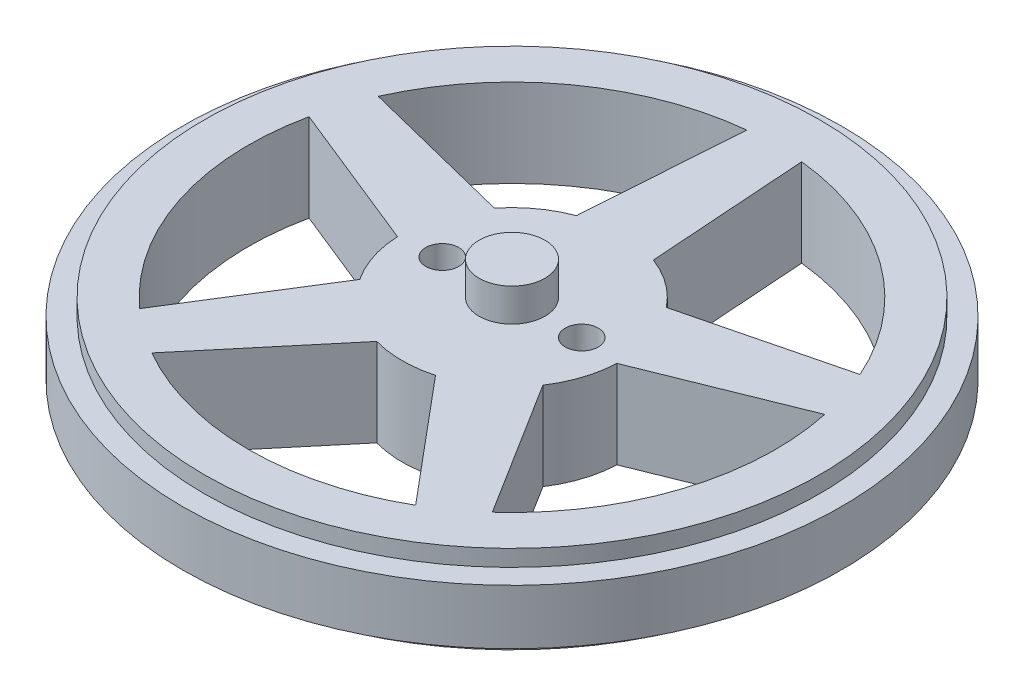
ISO-10303-21;
HEADER;
FILE_DESCRIPTION(('STEP AP214'),'2;1');
FILE_NAME('part.step','',(''),(''),'','','');
FILE_SCHEMA(('AUTOMOTIVE_DESIGN { 1 0 10303 214 1 1 1 1 }'));
ENDSEC;
DATA;
#1=APPLICATION_CONTEXT('core data for automotive mechanical design processes');
#2=APPLICATION_PROTOCOL_DEFINITION('international standard','automotive_design',2000,#1);
#3=PRODUCT_CONTEXT('',#1,'mechanical');
#4=PRODUCT('Part','Part','',(#3));
#5=PRODUCT_RELATED_PRODUCT_CATEGORY('part','',(#4));
#6=PRODUCT_DEFINITION_FORMATION('','',#4);
#7=PRODUCT_DEFINITION_CONTEXT('part definition',#1,'design');
#8=PRODUCT_DEFINITION('design','',#6,#7);
#9=PRODUCT_DEFINITION_SHAPE('','',#8);
#10=(LENGTH_UNIT() NAMED_UNIT(*) SI_UNIT(.MILLI.,.METRE.));
#11=(NAMED_UNIT(*) PLANE_ANGLE_UNIT() SI_UNIT($,.RADIAN.));
#12=(NAMED_UNIT(*) SI_UNIT($,.STERADIAN.) SOLID_ANGLE_UNIT());
#13=UNCERTAINTY_MEASURE_WITH_UNIT(LENGTH_MEASURE(1.E-05),#10,'distance_accuracy_value','');
#14=(GEOMETRIC_REPRESENTATION_CONTEXT(3) GLOBAL_UNCERTAINTY_ASSIGNED_CONTEXT((#13)) GLOBAL_UNIT_ASSIGNED_CONTEXT((#10,
#11,#12)) REPRESENTATION_CONTEXT('',''));
#15=CARTESIAN_POINT('',(0.,0.,0.));
#16=DIRECTION('',(0.,0.,1.));
#17=DIRECTION('',(1.,0.,0.));
#18=AXIS2_PLACEMENT_3D('',#15,#16,#17);
#19=CARTESIAN_POINT('',(0.,8.,0.));
#20=DIRECTION('',(0.,-1.,0.));
#21=DIRECTION('',(0.,0.,-1.));
#22=AXIS2_PLACEMENT_3D('',#19,#20,#21);
#23=CYLINDRICAL_SURFACE('',#22,28.);
#24=CARTESIAN_POINT('',(0.,6.5,0.));
#25=DIRECTION('',(0.,-1.,0.));
#26=DIRECTION('',(0.,0.,-1.));
#27=AXIS2_PLACEMENT_3D('',#24,#25,#26);
#28=CIRCLE('',#27,28.);
#29=CARTESIAN_POINT('',(0.,6.5,-28.));
#30=VERTEX_POINT('',#29);
#31=EDGE_CURVE('E205',#30,#30,#28,.T.);
#32=ORIENTED_EDGE('',*,*,#31,.F.);
#33=EDGE_LOOP('',(#32));
#34=FACE_BOUND('',#33,.T.);
#35=CARTESIAN_POINT('',(0.,8.,0.));
#36=DIRECTION('',(0.,1.,0.));
#37=DIRECTION('',(0.,0.,1.));
#38=AXIS2_PLACEMENT_3D('',#35,#36,#37);
#39=CIRCLE('',#38,28.);
#40=CARTESIAN_POINT('',(0.,8.,28.));
#41=VERTEX_POINT('',#40);
#42=EDGE_CURVE('E11',#41,#41,#39,.T.);
#43=ORIENTED_EDGE('',*,*,#42,.F.);
#44=EDGE_LOOP('',(#43));
#45=FACE_BOUND('',#44,.T.);
#46=ADVANCED_FACE('F35',(#34,#45),#23,.T.);
#47=CARTESIAN_POINT('',(0.,8.,0.));
#48=DIRECTION('',(0.,1.,0.));
#49=DIRECTION('',(0.,0.,1.));
#50=AXIS2_PLACEMENT_3D('',#47,#48,#49);
#51=PLANE('',#50);
#52=CARTESIAN_POINT('',(0.,8.,0.));
#53=DIRECTION('',(0.,1.,0.));
#54=DIRECTION('',(0.,0.,1.));
#55=AXIS2_PLACEMENT_3D('',#52,#53,#54);
#56=CIRCLE('',#55,3.);
#57=CARTESIAN_POINT('',(0.,8.,3.));
#58=VERTEX_POINT('',#57);
#59=EDGE_CURVE('E198',#58,#58,#56,.T.);
#60=ORIENTED_EDGE('',*,*,#59,.F.);
#61=EDGE_LOOP('',(#60));
#62=FACE_BOUND('',#61,.T.);
#63=CARTESIAN_POINT('',(6.35,8.,0.));
#64=DIRECTION('',(0.,1.,0.));
#65=DIRECTION('',(0.,0.,1.));
#66=AXIS2_PLACEMENT_3D('',#63,#64,#65);
#67=CIRCLE('',#66,1.5);
#68=CARTESIAN_POINT('',(6.35,8.,1.5));
#69=VERTEX_POINT('',#68);
#70=EDGE_CURVE('E207',#69,#69,#67,.T.);
#71=ORIENTED_EDGE('',*,*,#70,.F.);
#72=EDGE_LOOP('',(#71));
#73=FACE_BOUND('',#72,.T.);
#74=CARTESIAN_POINT('',(-6.35,8.,0.));
#75=DIRECTION('',(0.,1.,0.));
#76=DIRECTION('',(0.,0.,1.));
#77=AXIS2_PLACEMENT_3D('',#74,#75,#76);
#78=CIRCLE('',#77,1.5);
#79=CARTESIAN_POINT('',(-6.35,8.,1.5));
#80=VERTEX_POINT('',#79);
#81=EDGE_CURVE('E213',#80,#80,#78,.T.);
#82=ORIENTED_EDGE('',*,*,#81,.F.);
#83=EDGE_LOOP('',(#82));
#84=FACE_BOUND('',#83,.T.);
#85=ORIENTED_EDGE('',*,*,#42,.T.);
#86=EDGE_LOOP('',(#85));
#87=FACE_BOUND('',#86,.T.);
#88=DIRECTION('',(0.970061610860864,0.,0.242858953168348));
#89=VECTOR('',#88,1.);
#90=CARTESIAN_POINT('',(-7.82745958062809,8.,-6.22341357404708));
#91=LINE('',#90,#89);
#92=CARTESIAN_POINT('',(-21.9286406610389,8.,-9.75370282298126));
#93=VERTEX_POINT('',#92);
#94=CARTESIAN_POINT('',(-7.82745958062809,8.,-6.22341357404708));
#95=VERTEX_POINT('',#94);
#96=EDGE_CURVE('E346',#93,#95,#91,.T.);
#97=ORIENTED_EDGE('',*,*,#96,.F.);
#98=CARTESIAN_POINT('',(0.,8.,0.));
#99=DIRECTION('',(0.,1.,0.));
#100=DIRECTION('',(0.,0.,1.));
#101=AXIS2_PLACEMENT_3D('',#98,#99,#100);
#102=CIRCLE('',#101,24.);
#103=CARTESIAN_POINT('',(-2.5,8.,-23.86943652456));
#104=VERTEX_POINT('',#103);
#105=EDGE_CURVE('E344',#104,#93,#102,.T.);
#106=ORIENTED_EDGE('',*,*,#105,.F.);
#107=DIRECTION('',(0.0687929333953781,0.,-0.997630959982126));
#108=VECTOR('',#107,1.);
#109=CARTESIAN_POINT('',(-2.5,8.,-23.86943652456));
#110=LINE('',#109,#108);
#111=CARTESIAN_POINT('',(-3.5,8.,-9.3674969975976));
#112=VERTEX_POINT('',#111);
#113=EDGE_CURVE('E352',#112,#104,#110,.T.);
#114=ORIENTED_EDGE('',*,*,#113,.F.);
#115=CARTESIAN_POINT('',(0.,8.,0.));
#116=DIRECTION('',(0.,-1.,0.));
#117=DIRECTION('',(0.,0.,1.));
#118=AXIS2_PLACEMENT_3D('',#115,#116,#117);
#119=CIRCLE('',#118,10.);
#120=EDGE_CURVE('E349',#95,#112,#119,.T.);
#121=ORIENTED_EDGE('',*,*,#120,.F.);
#122=EDGE_LOOP('',(#97,#106,#114,#121));
#123=FACE_BOUND('',#122,.T.);
#124=DIRECTION('',(0.970061610860867,0.,-0.242858953168335));
#125=VECTOR('',#124,1.);
#126=CARTESIAN_POINT('',(7.82745958062818,8.,-6.22341357404697));
#127=LINE('',#126,#125);
#128=CARTESIAN_POINT('',(7.82745958062818,8.,-6.22341357404697));
#129=VERTEX_POINT('',#128);
#130=CARTESIAN_POINT('',(21.928640661039,8.,-9.75370282298095));
#131=VERTEX_POINT('',#130);
#132=EDGE_CURVE('E315',#129,#131,#127,.T.);
#133=ORIENTED_EDGE('',*,*,#132,.F.);
#134=CARTESIAN_POINT('',(0.,8.,0.));
#135=DIRECTION('',(0.,-1.,0.));
#136=DIRECTION('',(0.,0.,1.));
#137=AXIS2_PLACEMENT_3D('',#134,#135,#136);
#138=CIRCLE('',#137,10.);
#139=CARTESIAN_POINT('',(3.5,8.,-9.3674969975976));
#140=VERTEX_POINT('',#139);
#141=EDGE_CURVE('E313',#140,#129,#138,.T.);
#142=ORIENTED_EDGE('',*,*,#141,.F.);
#143=DIRECTION('',(0.0687929333953781,0.,0.997630959982126));
#144=VECTOR('',#143,1.);
#145=CARTESIAN_POINT('',(3.5,8.,-9.3674969975976));
#146=LINE('',#145,#144);
#147=CARTESIAN_POINT('',(2.5,8.,-23.86943652456));
#148=VERTEX_POINT('',#147);
#149=EDGE_CURVE('E321',#148,#140,#146,.T.);
#150=ORIENTED_EDGE('',*,*,#149,.F.);
#151=CARTESIAN_POINT('',(0.,8.,0.));
#152=DIRECTION('',(0.,1.,0.));
#153=DIRECTION('',(0.,0.,1.));
#154=AXIS2_PLACEMENT_3D('',#151,#152,#153);
#155=CIRCLE('',#154,24.);
#156=EDGE_CURVE('E318',#131,#148,#155,.T.);
#157=ORIENTED_EDGE('',*,*,#156,.F.);
#158=EDGE_LOOP('',(#133,#142,#150,#157));
#159=FACE_BOUND('',#158,.T.);
#160=DIRECTION('',(0.530738113298107,0.,0.847535872451878));
#161=VECTOR('',#160,1.);
#162=CARTESIAN_POINT('',(8.33763606639418,8.,5.52121588278914));
#163=LINE('',#162,#161);
#164=CARTESIAN_POINT('',(8.33763606639418,8.,5.52121588278914));
#165=VERTEX_POINT('',#164);
#166=CARTESIAN_POINT('',(16.052645255605,8.,17.841316663792));
#167=VERTEX_POINT('',#166);
#168=EDGE_CURVE('E284',#165,#167,#163,.T.);
#169=ORIENTED_EDGE('',*,*,#168,.F.);
#170=CARTESIAN_POINT('',(0.,8.,0.));
#171=DIRECTION('',(0.,-1.,0.));
#172=DIRECTION('',(0.,0.,1.));
#173=AXIS2_PLACEMENT_3D('',#170,#171,#172);
#174=CIRCLE('',#173,10.);
#175=CARTESIAN_POINT('',(9.9905785412528,8.,0.433982040019112));
#176=VERTEX_POINT('',#175);
#177=EDGE_CURVE('E282',#176,#165,#174,.T.);
#178=ORIENTED_EDGE('',*,*,#177,.F.);
#179=DIRECTION('',(-0.927545239836716,0.,0.3737108883298));
#180=VECTOR('',#179,1.);
#181=CARTESIAN_POINT('',(9.9905785412528,8.,0.433982040019112));
#182=LINE('',#181,#180);
#183=CARTESIAN_POINT('',(23.4737256329137,8.,-4.99842024150518));
#184=VERTEX_POINT('',#183);
#185=EDGE_CURVE('E290',#184,#176,#182,.T.);
#186=ORIENTED_EDGE('',*,*,#185,.F.);
#187=CARTESIAN_POINT('',(0.,8.,0.));
#188=DIRECTION('',(0.,1.,0.));
#189=DIRECTION('',(0.,0.,1.));
#190=AXIS2_PLACEMENT_3D('',#187,#188,#189);
#191=CIRCLE('',#190,24.);
#192=EDGE_CURVE('E287',#167,#184,#191,.T.);
#193=ORIENTED_EDGE('',*,*,#192,.F.);
#194=EDGE_LOOP('',(#169,#178,#186,#193));
#195=FACE_BOUND('',#194,.T.);
#196=DIRECTION('',(-0.642047417717648,0.,0.766664929028386));
#197=VECTOR('',#196,1.);
#198=CARTESIAN_POINT('',(-2.67451710576965,8.,9.63571264883639));
#199=LINE('',#198,#197);
#200=CARTESIAN_POINT('',(-2.67451710576965,8.,9.63571264883639));
#201=VERTEX_POINT('',#200);
#202=CARTESIAN_POINT('',(-12.0075602837305,8.,20.7802429252542));
#203=VERTEX_POINT('',#202);
#204=EDGE_CURVE('E253',#201,#203,#199,.T.);
#205=ORIENTED_EDGE('',*,*,#204,.F.);
#206=CARTESIAN_POINT('',(0.,8.,0.));
#207=DIRECTION('',(0.,-1.,0.));
#208=DIRECTION('',(0.,0.,1.));
#209=AXIS2_PLACEMENT_3D('',#206,#207,#208);
#210=CIRCLE('',#209,10.);
#211=CARTESIAN_POINT('',(2.67451710576952,8.,9.63571264883643));
#212=VERTEX_POINT('',#211);
#213=EDGE_CURVE('E251',#212,#201,#210,.T.);
#214=ORIENTED_EDGE('',*,*,#213,.F.);
#215=DIRECTION('',(-0.642047417717637,0.,-0.766664929028395));
#216=VECTOR('',#215,1.);
#217=CARTESIAN_POINT('',(2.67451710576952,8.,9.63571264883643));
#218=LINE('',#217,#216);
#219=CARTESIAN_POINT('',(12.0075602837302,8.,20.7802429252544));
#220=VERTEX_POINT('',#219);
#221=EDGE_CURVE('E259',#220,#212,#218,.T.);
#222=ORIENTED_EDGE('',*,*,#221,.F.);
#223=CARTESIAN_POINT('',(0.,8.,0.));
#224=DIRECTION('',(0.,1.,0.));
#225=DIRECTION('',(0.,0.,1.));
#226=AXIS2_PLACEMENT_3D('',#223,#224,#225);
#227=CIRCLE('',#226,24.);
#228=EDGE_CURVE('E256',#203,#220,#227,.T.);
#229=ORIENTED_EDGE('',*,*,#228,.F.);
#230=EDGE_LOOP('',(#205,#214,#222,#229));
#231=FACE_BOUND('',#230,.T.);
#232=DIRECTION('',(-0.927545239836711,0.,-0.373710888329813));
#233=VECTOR('',#232,1.);
#234=CARTESIAN_POINT('',(-9.9905785412528,8.,0.433982040018968));
#235=LINE('',#234,#233);
#236=CARTESIAN_POINT('',(-9.9905785412528,8.,0.433982040018968));
#237=VERTEX_POINT('',#236);
#238=CARTESIAN_POINT('',(-23.4737256329137,8.,-4.99842024150553));
#239=VERTEX_POINT('',#238);
#240=EDGE_CURVE('E222',#237,#239,#235,.T.);
#241=ORIENTED_EDGE('',*,*,#240,.F.);
#242=CARTESIAN_POINT('',(0.,8.,0.));
#243=DIRECTION('',(0.,-1.,0.));
#244=DIRECTION('',(0.,0.,1.));
#245=AXIS2_PLACEMENT_3D('',#242,#243,#244);
#246=CIRCLE('',#245,10.);
#247=CARTESIAN_POINT('',(-8.33763606639425,8.,5.52121588278903));
#248=VERTEX_POINT('',#247);
#249=EDGE_CURVE('E220',#248,#237,#246,.T.);
#250=ORIENTED_EDGE('',*,*,#249,.F.);
#251=DIRECTION('',(0.530738113298119,0.,-0.84753587245187));
#252=VECTOR('',#251,1.);
#253=CARTESIAN_POINT('',(-8.33763606639425,8.,5.52121588278903));
#254=LINE('',#253,#252);
#255=CARTESIAN_POINT('',(-16.0526452556052,8.,17.8413166637918));
#256=VERTEX_POINT('',#255);
#257=EDGE_CURVE('E228',#256,#248,#254,.T.);
#258=ORIENTED_EDGE('',*,*,#257,.F.);
#259=CARTESIAN_POINT('',(0.,8.,0.));
#260=DIRECTION('',(0.,1.,0.));
#261=DIRECTION('',(0.,0.,1.));
#262=AXIS2_PLACEMENT_3D('',#259,#260,#261);
#263=CIRCLE('',#262,24.);
#264=EDGE_CURVE('E225',#239,#256,#263,.T.);
#265=ORIENTED_EDGE('',*,*,#264,.F.);
#266=EDGE_LOOP('',(#241,#250,#258,#265));
#267=FACE_BOUND('',#266,.T.);
#268=ADVANCED_FACE('F382',(#62,#73,#84,#87,#123,#159,#195,#231,#267),#51,.T.);
#269=CARTESIAN_POINT('',(0.,0.,0.));
#270=DIRECTION('',(0.,1.,0.));
#271=DIRECTION('',(0.,0.,1.));
#272=AXIS2_PLACEMENT_3D('',#269,#270,#271);
#273=PLANE('',#272);
#274=CARTESIAN_POINT('',(6.35,0.,0.));
#275=DIRECTION('',(0.,1.,0.));
#276=DIRECTION('',(0.,0.,1.));
#277=AXIS2_PLACEMENT_3D('',#274,#275,#276);
#278=CIRCLE('',#277,1.5);
#279=CARTESIAN_POINT('',(6.35,0.,1.5));
#280=VERTEX_POINT('',#279);
#281=EDGE_CURVE('E210',#280,#280,#278,.F.);
#282=ORIENTED_EDGE('',*,*,#281,.F.);
#283=EDGE_LOOP('',(#282));
#284=FACE_BOUND('',#283,.T.);
#285=CARTESIAN_POINT('',(-6.35,0.,0.));
#286=DIRECTION('',(0.,1.,0.));
#287=DIRECTION('',(0.,0.,1.));
#288=AXIS2_PLACEMENT_3D('',#285,#286,#287);
#289=CIRCLE('',#288,1.5);
#290=CARTESIAN_POINT('',(-6.35,0.,1.5));
#291=VERTEX_POINT('',#290);
#292=EDGE_CURVE('E216',#291,#291,#289,.F.);
#293=ORIENTED_EDGE('',*,*,#292,.F.);
#294=EDGE_LOOP('',(#293));
#295=FACE_BOUND('',#294,.T.);
#296=CARTESIAN_POINT('',(0.,0.,0.));
#297=DIRECTION('',(0.,-1.,0.));
#298=DIRECTION('',(0.,0.,1.));
#299=AXIS2_PLACEMENT_3D('',#296,#297,#298);
#300=CIRCLE('',#299,10.);
#301=CARTESIAN_POINT('',(2.67451710576951,0.,9.63571264883643));
#302=VERTEX_POINT('',#301);
#303=CARTESIAN_POINT('',(-2.67451710576965,0.,9.63571264883639));
#304=VERTEX_POINT('',#303);
#305=EDGE_CURVE('E250',#302,#304,#300,.T.);
#306=ORIENTED_EDGE('',*,*,#305,.T.);
#307=DIRECTION('',(-0.642047417717648,0.,0.766664929028386));
#308=VECTOR('',#307,1.);
#309=CARTESIAN_POINT('',(-2.67451710576965,0.,9.63571264883639));
#310=LINE('',#309,#308);
#311=CARTESIAN_POINT('',(-12.0075602837305,0.,20.7802429252542));
#312=VERTEX_POINT('',#311);
#313=EDGE_CURVE('E264',#304,#312,#310,.T.);
#314=ORIENTED_EDGE('',*,*,#313,.T.);
#315=CARTESIAN_POINT('',(0.,0.,0.));
#316=DIRECTION('',(0.,1.,0.));
#317=DIRECTION('',(0.,0.,1.));
#318=AXIS2_PLACEMENT_3D('',#315,#316,#317);
#319=CIRCLE('',#318,24.);
#320=CARTESIAN_POINT('',(12.0075602837302,0.,20.7802429252544));
#321=VERTEX_POINT('',#320);
#322=EDGE_CURVE('E267',#312,#321,#319,.T.);
#323=ORIENTED_EDGE('',*,*,#322,.T.);
#324=DIRECTION('',(-0.642047417717637,0.,-0.766664929028395));
#325=VECTOR('',#324,1.);
#326=CARTESIAN_POINT('',(2.67451710576952,0.,9.63571264883643));
#327=LINE('',#326,#325);
#328=EDGE_CURVE('E254',#321,#302,#327,.T.);
#329=ORIENTED_EDGE('',*,*,#328,.T.);
#330=EDGE_LOOP('',(#306,#314,#323,#329));
#331=FACE_BOUND('',#330,.T.);
#332=CARTESIAN_POINT('',(0.,0.,0.));
#333=DIRECTION('',(0.,-1.,0.));
#334=DIRECTION('',(0.,0.,1.));
#335=AXIS2_PLACEMENT_3D('',#332,#333,#334);
#336=CIRCLE('',#335,10.);
#337=CARTESIAN_POINT('',(3.5,0.,-9.3674969975976));
#338=VERTEX_POINT('',#337);
#339=CARTESIAN_POINT('',(7.82745958062818,0.,-6.22341357404697));
#340=VERTEX_POINT('',#339);
#341=EDGE_CURVE('E312',#338,#340,#336,.T.);
#342=ORIENTED_EDGE('',*,*,#341,.T.);
#343=DIRECTION('',(0.970061610860867,0.,-0.242858953168335));
#344=VECTOR('',#343,1.);
#345=CARTESIAN_POINT('',(7.82745958062818,0.,-6.22341357404697));
#346=LINE('',#345,#344);
#347=CARTESIAN_POINT('',(21.928640661039,0.,-9.75370282298095));
#348=VERTEX_POINT('',#347);
#349=EDGE_CURVE('E326',#340,#348,#346,.T.);
#350=ORIENTED_EDGE('',*,*,#349,.T.);
#351=CARTESIAN_POINT('',(0.,0.,0.));
#352=DIRECTION('',(0.,1.,0.));
#353=DIRECTION('',(0.,0.,1.));
#354=AXIS2_PLACEMENT_3D('',#351,#352,#353);
#355=CIRCLE('',#354,24.);
#356=CARTESIAN_POINT('',(2.5,0.,-23.86943652456));
#357=VERTEX_POINT('',#356);
#358=EDGE_CURVE('E329',#348,#357,#355,.T.);
#359=ORIENTED_EDGE('',*,*,#358,.T.);
#360=DIRECTION('',(0.0687929333953781,0.,0.997630959982126));
#361=VECTOR('',#360,1.);
#362=CARTESIAN_POINT('',(3.5,0.,-9.3674969975976));
#363=LINE('',#362,#361);
#364=EDGE_CURVE('E316',#357,#338,#363,.T.);
#365=ORIENTED_EDGE('',*,*,#364,.T.);
#366=EDGE_LOOP('',(#342,#350,#359,#365));
#367=FACE_BOUND('',#366,.T.);
#368=CARTESIAN_POINT('',(0.,0.,0.));
#369=DIRECTION('',(0.,1.,0.));
#370=DIRECTION('',(0.,0.,1.));
#371=AXIS2_PLACEMENT_3D('',#368,#369,#370);
#372=CIRCLE('',#371,28.);
#373=CARTESIAN_POINT('',(0.,0.,28.));
#374=VERTEX_POINT('',#373);
#375=EDGE_CURVE('E39',#374,#374,#372,.T.);
#376=ORIENTED_EDGE('',*,*,#375,.F.);
#377=EDGE_LOOP('',(#376));
#378=FACE_BOUND('',#377,.T.);
#379=CARTESIAN_POINT('',(0.,0.,0.));
#380=DIRECTION('',(0.,1.,0.));
#381=DIRECTION('',(0.,0.,1.));
#382=AXIS2_PLACEMENT_3D('',#379,#380,#381);
#383=CIRCLE('',#382,24.);
#384=CARTESIAN_POINT('',(-2.5,0.,-23.86943652456));
#385=VERTEX_POINT('',#384);
#386=CARTESIAN_POINT('',(-21.9286406610389,0.,-9.75370282298126));
#387=VERTEX_POINT('',#386);
#388=EDGE_CURVE('E343',#385,#387,#383,.T.);
#389=ORIENTED_EDGE('',*,*,#388,.T.);
#390=DIRECTION('',(0.970061610860864,0.,0.242858953168348));
#391=VECTOR('',#390,1.);
#392=CARTESIAN_POINT('',(-7.82745958062809,0.,-6.22341357404708));
#393=LINE('',#392,#391);
#394=CARTESIAN_POINT('',(-7.82745958062809,0.,-6.22341357404708));
#395=VERTEX_POINT('',#394);
#396=EDGE_CURVE('E357',#387,#395,#393,.T.);
#397=ORIENTED_EDGE('',*,*,#396,.T.);
#398=CARTESIAN_POINT('',(0.,0.,0.));
#399=DIRECTION('',(0.,-1.,0.));
#400=DIRECTION('',(0.,0.,1.));
#401=AXIS2_PLACEMENT_3D('',#398,#399,#400);
#402=CIRCLE('',#401,10.);
#403=CARTESIAN_POINT('',(-3.5,0.,-9.3674969975976));
#404=VERTEX_POINT('',#403);
#405=EDGE_CURVE('E360',#395,#404,#402,.T.);
#406=ORIENTED_EDGE('',*,*,#405,.T.);
#407=DIRECTION('',(0.0687929333953781,0.,-0.997630959982126));
#408=VECTOR('',#407,1.);
#409=CARTESIAN_POINT('',(-2.5,0.,-23.86943652456));
#410=LINE('',#409,#408);
#411=EDGE_CURVE('E347',#404,#385,#410,.T.);
#412=ORIENTED_EDGE('',*,*,#411,.T.);
#413=EDGE_LOOP('',(#389,#397,#406,#412));
#414=FACE_BOUND('',#413,.T.);
#415=CARTESIAN_POINT('',(0.,0.,0.));
#416=DIRECTION('',(0.,-1.,0.));
#417=DIRECTION('',(0.,0.,1.));
#418=AXIS2_PLACEMENT_3D('',#415,#416,#417);
#419=CIRCLE('',#418,10.);
#420=CARTESIAN_POINT('',(9.9905785412528,0.,0.433982040019112));
#421=VERTEX_POINT('',#420);
#422=CARTESIAN_POINT('',(8.33763606639418,0.,5.52121588278914));
#423=VERTEX_POINT('',#422);
#424=EDGE_CURVE('E281',#421,#423,#419,.T.);
#425=ORIENTED_EDGE('',*,*,#424,.T.);
#426=DIRECTION('',(0.530738113298107,0.,0.847535872451878));
#427=VECTOR('',#426,1.);
#428=CARTESIAN_POINT('',(8.33763606639418,0.,5.52121588278914));
#429=LINE('',#428,#427);
#430=CARTESIAN_POINT('',(16.052645255605,0.,17.841316663792));
#431=VERTEX_POINT('',#430);
#432=EDGE_CURVE('E295',#423,#431,#429,.T.);
#433=ORIENTED_EDGE('',*,*,#432,.T.);
#434=CARTESIAN_POINT('',(0.,0.,0.));
#435=DIRECTION('',(0.,1.,0.));
#436=DIRECTION('',(0.,0.,1.));
#437=AXIS2_PLACEMENT_3D('',#434,#435,#436);
#438=CIRCLE('',#437,24.);
#439=CARTESIAN_POINT('',(23.4737256329137,0.,-4.99842024150518));
#440=VERTEX_POINT('',#439);
#441=EDGE_CURVE('E298',#431,#440,#438,.T.);
#442=ORIENTED_EDGE('',*,*,#441,.T.);
#443=DIRECTION('',(-0.927545239836716,0.,0.3737108883298));
#444=VECTOR('',#443,1.);
#445=CARTESIAN_POINT('',(9.9905785412528,0.,0.433982040019112));
#446=LINE('',#445,#444);
#447=EDGE_CURVE('E285',#440,#421,#446,.T.);
#448=ORIENTED_EDGE('',*,*,#447,.T.);
#449=EDGE_LOOP('',(#425,#433,#442,#448));
#450=FACE_BOUND('',#449,.T.);
#451=CARTESIAN_POINT('',(0.,0.,0.));
#452=DIRECTION('',(0.,-1.,0.));
#453=DIRECTION('',(0.,0.,1.));
#454=AXIS2_PLACEMENT_3D('',#451,#452,#453);
#455=CIRCLE('',#454,10.);
#456=CARTESIAN_POINT('',(-8.33763606639425,0.,5.52121588278903));
#457=VERTEX_POINT('',#456);
#458=CARTESIAN_POINT('',(-9.9905785412528,0.,0.433982040018968));
#459=VERTEX_POINT('',#458);
#460=EDGE_CURVE('E219',#457,#459,#455,.T.);
#461=ORIENTED_EDGE('',*,*,#460,.T.);
#462=DIRECTION('',(-0.927545239836711,0.,-0.373710888329813));
#463=VECTOR('',#462,1.);
#464=CARTESIAN_POINT('',(-9.9905785412528,0.,0.433982040018968));
#465=LINE('',#464,#463);
#466=CARTESIAN_POINT('',(-23.4737256329137,0.,-4.99842024150553));
#467=VERTEX_POINT('',#466);
#468=EDGE_CURVE('E233',#459,#467,#465,.T.);
#469=ORIENTED_EDGE('',*,*,#468,.T.);
#470=CARTESIAN_POINT('',(0.,0.,0.));
#471=DIRECTION('',(0.,1.,0.));
#472=DIRECTION('',(0.,0.,1.));
#473=AXIS2_PLACEMENT_3D('',#470,#471,#472);
#474=CIRCLE('',#473,24.);
#475=CARTESIAN_POINT('',(-16.0526452556052,0.,17.8413166637918));
#476=VERTEX_POINT('',#475);
#477=EDGE_CURVE('E236',#467,#476,#474,.T.);
#478=ORIENTED_EDGE('',*,*,#477,.T.);
#479=DIRECTION('',(0.530738113298119,0.,-0.84753587245187));
#480=VECTOR('',#479,1.);
#481=CARTESIAN_POINT('',(-8.33763606639425,0.,5.52121588278903));
#482=LINE('',#481,#480);
#483=EDGE_CURVE('E223',#476,#457,#482,.T.);
#484=ORIENTED_EDGE('',*,*,#483,.T.);
#485=EDGE_LOOP('',(#461,#469,#478,#484));
#486=FACE_BOUND('',#485,.T.);
#487=ADVANCED_FACE('F379',(#284,#295,#331,#367,#378,#414,#450,#486),#273,.F.);
#488=CARTESIAN_POINT('',(0.,1.5,0.));
#489=DIRECTION('',(0.,-1.,0.));
#490=DIRECTION('',(0.,0.,-1.));
#491=AXIS2_PLACEMENT_3D('',#488,#489,#490);
#492=CIRCLE('',#491,28.);
#493=CARTESIAN_POINT('',(0.,1.5,-28.));
#494=VERTEX_POINT('',#493);
#495=EDGE_CURVE('E190',#494,#494,#492,.T.);
#496=ORIENTED_EDGE('',*,*,#495,.T.);
#497=EDGE_LOOP('',(#496));
#498=FACE_BOUND('',#497,.T.);
#499=ORIENTED_EDGE('',*,*,#375,.T.);
#500=EDGE_LOOP('',(#499));
#501=FACE_BOUND('',#500,.T.);
#502=ADVANCED_FACE('F37',(#498,#501),#23,.T.);
#503=CARTESIAN_POINT('',(0.,8.,0.));
#504=DIRECTION('',(0.,-1.,0.));
#505=DIRECTION('',(0.,0.,-1.));
#506=AXIS2_PLACEMENT_3D('',#503,#504,#505);
#507=CYLINDRICAL_SURFACE('',#506,24.);
#508=ORIENTED_EDGE('',*,*,#388,.F.);
#509=DIRECTION('',(0.,-1.,0.));
#510=VECTOR('',#509,1.);
#511=CARTESIAN_POINT('',(-2.5,8.,-23.86943652456));
#512=LINE('',#511,#510);
#513=EDGE_CURVE('E354',#104,#385,#512,.T.);
#514=ORIENTED_EDGE('',*,*,#513,.F.);
#515=ORIENTED_EDGE('',*,*,#105,.T.);
#516=DIRECTION('',(0.,-1.,0.));
#517=VECTOR('',#516,1.);
#518=CARTESIAN_POINT('',(-21.9286406610389,8.,-9.75370282298126));
#519=LINE('',#518,#517);
#520=EDGE_CURVE('E371',#93,#387,#519,.T.);
#521=ORIENTED_EDGE('',*,*,#520,.T.);
#522=EDGE_LOOP('',(#508,#514,#515,#521));
#523=FACE_BOUND('',#522,.T.);
#524=ADVANCED_FACE('F424',(#523),#507,.F.);
#525=CARTESIAN_POINT('',(-7.82745958062809,8.,-6.22341357404708));
#526=DIRECTION('',(0.242858953168348,0.,-0.970061610860864));
#527=DIRECTION('',(-0.970061610860864,0.,-0.242858953168348));
#528=AXIS2_PLACEMENT_3D('',#525,#526,#527);
#529=PLANE('',#528);
#530=ORIENTED_EDGE('',*,*,#396,.F.);
#531=ORIENTED_EDGE('',*,*,#520,.F.);
#532=ORIENTED_EDGE('',*,*,#96,.T.);
#533=DIRECTION('',(0.,-1.,0.));
#534=VECTOR('',#533,1.);
#535=CARTESIAN_POINT('',(-7.82745958062809,8.,-6.22341357404708));
#536=LINE('',#535,#534);
#537=EDGE_CURVE('E369',#95,#395,#536,.T.);
#538=ORIENTED_EDGE('',*,*,#537,.T.);
#539=EDGE_LOOP('',(#530,#531,#532,#538));
#540=FACE_BOUND('',#539,.T.);
#541=ADVANCED_FACE('F430',(#540),#529,.T.);
#542=CARTESIAN_POINT('',(0.,8.,0.));
#543=DIRECTION('',(0.,-1.,0.));
#544=DIRECTION('',(0.,0.,-1.));
#545=AXIS2_PLACEMENT_3D('',#542,#543,#544);
#546=CYLINDRICAL_SURFACE('',#545,10.);
#547=ORIENTED_EDGE('',*,*,#405,.F.);
#548=ORIENTED_EDGE('',*,*,#537,.F.);
#549=ORIENTED_EDGE('',*,*,#120,.T.);
#550=DIRECTION('',(0.,-1.,0.));
#551=VECTOR('',#550,1.);
#552=CARTESIAN_POINT('',(-3.5,8.,-9.3674969975976));
#553=LINE('',#552,#551);
#554=EDGE_CURVE('E367',#112,#404,#553,.T.);
#555=ORIENTED_EDGE('',*,*,#554,.T.);
#556=EDGE_LOOP('',(#547,#548,#549,#555));
#557=FACE_BOUND('',#556,.T.);
#558=ADVANCED_FACE('F435',(#557),#546,.T.);
#559=CARTESIAN_POINT('',(-2.5,8.,-23.86943652456));
#560=DIRECTION('',(-0.997630959982126,0.,-0.0687929333953781));
#561=DIRECTION('',(-0.0687929333953781,0.,0.997630959982127));
#562=AXIS2_PLACEMENT_3D('',#559,#560,#561);
#563=PLANE('',#562);
#564=ORIENTED_EDGE('',*,*,#411,.F.);
#565=ORIENTED_EDGE('',*,*,#554,.F.);
#566=ORIENTED_EDGE('',*,*,#113,.T.);
#567=ORIENTED_EDGE('',*,*,#513,.T.);
#568=EDGE_LOOP('',(#564,#565,#566,#567));
#569=FACE_BOUND('',#568,.T.);
#570=ADVANCED_FACE('F441',(#569),#563,.T.);
#571=CARTESIAN_POINT('',(0.,8.,0.));
#572=DIRECTION('',(0.,-1.,0.));
#573=DIRECTION('',(0.,0.,-1.));
#574=AXIS2_PLACEMENT_3D('',#571,#572,#573);
#575=CYLINDRICAL_SURFACE('',#574,10.);
#576=ORIENTED_EDGE('',*,*,#341,.F.);
#577=DIRECTION('',(0.,-1.,0.));
#578=VECTOR('',#577,1.);
#579=CARTESIAN_POINT('',(3.5,8.,-9.3674969975976));
#580=LINE('',#579,#578);
#581=EDGE_CURVE('E323',#140,#338,#580,.T.);
#582=ORIENTED_EDGE('',*,*,#581,.F.);
#583=ORIENTED_EDGE('',*,*,#141,.T.);
#584=DIRECTION('',(0.,-1.,0.));
#585=VECTOR('',#584,1.);
#586=CARTESIAN_POINT('',(7.82745958062818,8.,-6.22341357404697));
#587=LINE('',#586,#585);
#588=EDGE_CURVE('E340',#129,#340,#587,.T.);
#589=ORIENTED_EDGE('',*,*,#588,.T.);
#590=EDGE_LOOP('',(#576,#582,#583,#589));
#591=FACE_BOUND('',#590,.T.);
#592=ADVANCED_FACE('F445',(#591),#575,.T.);
#593=CARTESIAN_POINT('',(7.82745958062818,8.,-6.22341357404697));
#594=DIRECTION('',(-0.242858953168335,0.,-0.970061610860867));
#595=DIRECTION('',(-0.970061610860867,0.,0.242858953168335));
#596=AXIS2_PLACEMENT_3D('',#593,#594,#595);
#597=PLANE('',#596);
#598=ORIENTED_EDGE('',*,*,#349,.F.);
#599=ORIENTED_EDGE('',*,*,#588,.F.);
#600=ORIENTED_EDGE('',*,*,#132,.T.);
#601=DIRECTION('',(0.,-1.,0.));
#602=VECTOR('',#601,1.);
#603=CARTESIAN_POINT('',(21.928640661039,8.,-9.75370282298095));
#604=LINE('',#603,#602);
#605=EDGE_CURVE('E338',#131,#348,#604,.T.);
#606=ORIENTED_EDGE('',*,*,#605,.T.);
#607=EDGE_LOOP('',(#598,#599,#600,#606));
#608=FACE_BOUND('',#607,.T.);
#609=ADVANCED_FACE('F449',(#608),#597,.T.);
#610=CARTESIAN_POINT('',(0.,8.,0.));
#611=DIRECTION('',(0.,-1.,0.));
#612=DIRECTION('',(0.,0.,-1.));
#613=AXIS2_PLACEMENT_3D('',#610,#611,#612);
#614=CYLINDRICAL_SURFACE('',#613,24.);
#615=ORIENTED_EDGE('',*,*,#358,.F.);
#616=ORIENTED_EDGE('',*,*,#605,.F.);
#617=ORIENTED_EDGE('',*,*,#156,.T.);
#618=DIRECTION('',(0.,-1.,0.));
#619=VECTOR('',#618,1.);
#620=CARTESIAN_POINT('',(2.5,8.,-23.86943652456));
#621=LINE('',#620,#619);
#622=EDGE_CURVE('E336',#148,#357,#621,.T.);
#623=ORIENTED_EDGE('',*,*,#622,.T.);
#624=EDGE_LOOP('',(#615,#616,#617,#623));
#625=FACE_BOUND('',#624,.T.);
#626=ADVANCED_FACE('F453',(#625),#614,.F.);
#627=CARTESIAN_POINT('',(3.5,8.,-9.3674969975976));
#628=DIRECTION('',(0.997630959982126,0.,-0.0687929333953781));
#629=DIRECTION('',(-0.0687929333953781,0.,-0.997630959982127));
#630=AXIS2_PLACEMENT_3D('',#627,#628,#629);
#631=PLANE('',#630);
#632=ORIENTED_EDGE('',*,*,#364,.F.);
#633=ORIENTED_EDGE('',*,*,#622,.F.);
#634=ORIENTED_EDGE('',*,*,#149,.T.);
#635=ORIENTED_EDGE('',*,*,#581,.T.);
#636=EDGE_LOOP('',(#632,#633,#634,#635));
#637=FACE_BOUND('',#636,.T.);
#638=ADVANCED_FACE('F457',(#637),#631,.T.);
#639=CARTESIAN_POINT('',(0.,8.,0.));
#640=DIRECTION('',(0.,-1.,0.));
#641=DIRECTION('',(0.,0.,-1.));
#642=AXIS2_PLACEMENT_3D('',#639,#640,#641);
#643=CYLINDRICAL_SURFACE('',#642,10.);
#644=ORIENTED_EDGE('',*,*,#424,.F.);
#645=DIRECTION('',(0.,-1.,0.));
#646=VECTOR('',#645,1.);
#647=CARTESIAN_POINT('',(9.9905785412528,8.,0.433982040019112));
#648=LINE('',#647,#646);
#649=EDGE_CURVE('E292',#176,#421,#648,.T.);
#650=ORIENTED_EDGE('',*,*,#649,.F.);
#651=ORIENTED_EDGE('',*,*,#177,.T.);
#652=DIRECTION('',(0.,-1.,0.));
#653=VECTOR('',#652,1.);
#654=CARTESIAN_POINT('',(8.33763606639418,8.,5.52121588278914));
#655=LINE('',#654,#653);
#656=EDGE_CURVE('E309',#165,#423,#655,.T.);
#657=ORIENTED_EDGE('',*,*,#656,.T.);
#658=EDGE_LOOP('',(#644,#650,#651,#657));
#659=FACE_BOUND('',#658,.T.);
#660=ADVANCED_FACE('F461',(#659),#643,.T.);
#661=CARTESIAN_POINT('',(8.33763606639418,8.,5.52121588278914));
#662=DIRECTION('',(0.847535872451878,0.,-0.530738113298107));
#663=DIRECTION('',(-0.530738113298107,0.,-0.847535872451878));
#664=AXIS2_PLACEMENT_3D('',#661,#662,#663);
#665=PLANE('',#664);
#666=ORIENTED_EDGE('',*,*,#432,.F.);
#667=ORIENTED_EDGE('',*,*,#656,.F.);
#668=ORIENTED_EDGE('',*,*,#168,.T.);
#669=DIRECTION('',(0.,-1.,0.));
#670=VECTOR('',#669,1.);
#671=CARTESIAN_POINT('',(16.052645255605,8.,17.841316663792));
#672=LINE('',#671,#670);
#673=EDGE_CURVE('E307',#167,#431,#672,.T.);
#674=ORIENTED_EDGE('',*,*,#673,.T.);
#675=EDGE_LOOP('',(#666,#667,#668,#674));
#676=FACE_BOUND('',#675,.T.);
#677=ADVANCED_FACE('F465',(#676),#665,.T.);
#678=CARTESIAN_POINT('',(0.,8.,0.));
#679=DIRECTION('',(0.,-1.,0.));
#680=DIRECTION('',(0.,0.,-1.));
#681=AXIS2_PLACEMENT_3D('',#678,#679,#680);
#682=CYLINDRICAL_SURFACE('',#681,24.);
#683=ORIENTED_EDGE('',*,*,#441,.F.);
#684=ORIENTED_EDGE('',*,*,#673,.F.);
#685=ORIENTED_EDGE('',*,*,#192,.T.);
#686=DIRECTION('',(0.,-1.,0.));
#687=VECTOR('',#686,1.);
#688=CARTESIAN_POINT('',(23.4737256329137,8.,-4.99842024150518));
#689=LINE('',#688,#687);
#690=EDGE_CURVE('E305',#184,#440,#689,.T.);
#691=ORIENTED_EDGE('',*,*,#690,.T.);
#692=EDGE_LOOP('',(#683,#684,#685,#691));
#693=FACE_BOUND('',#692,.T.);
#694=ADVANCED_FACE('F469',(#693),#682,.F.);
#695=CARTESIAN_POINT('',(9.9905785412528,8.,0.433982040019112));
#696=DIRECTION('',(0.3737108883298,0.,0.927545239836716));
#697=DIRECTION('',(0.927545239836716,0.,-0.3737108883298));
#698=AXIS2_PLACEMENT_3D('',#695,#696,#697);
#699=PLANE('',#698);
#700=ORIENTED_EDGE('',*,*,#447,.F.);
#701=ORIENTED_EDGE('',*,*,#690,.F.);
#702=ORIENTED_EDGE('',*,*,#185,.T.);
#703=ORIENTED_EDGE('',*,*,#649,.T.);
#704=EDGE_LOOP('',(#700,#701,#702,#703));
#705=FACE_BOUND('',#704,.T.);
#706=ADVANCED_FACE('F473',(#705),#699,.T.);
#707=CARTESIAN_POINT('',(0.,8.,0.));
#708=DIRECTION('',(0.,-1.,0.));
#709=DIRECTION('',(0.,0.,-1.));
#710=AXIS2_PLACEMENT_3D('',#707,#708,#709);
#711=CYLINDRICAL_SURFACE('',#710,10.);
#712=ORIENTED_EDGE('',*,*,#305,.F.);
#713=DIRECTION('',(0.,-1.,0.));
#714=VECTOR('',#713,1.);
#715=CARTESIAN_POINT('',(2.67451710576952,8.,9.63571264883643));
#716=LINE('',#715,#714);
#717=EDGE_CURVE('E261',#212,#302,#716,.T.);
#718=ORIENTED_EDGE('',*,*,#717,.F.);
#719=ORIENTED_EDGE('',*,*,#213,.T.);
#720=DIRECTION('',(0.,-1.,0.));
#721=VECTOR('',#720,1.);
#722=CARTESIAN_POINT('',(-2.67451710576965,8.,9.63571264883639));
#723=LINE('',#722,#721);
#724=EDGE_CURVE('E278',#201,#304,#723,.T.);
#725=ORIENTED_EDGE('',*,*,#724,.T.);
#726=EDGE_LOOP('',(#712,#718,#719,#725));
#727=FACE_BOUND('',#726,.T.);
#728=ADVANCED_FACE('F477',(#727),#711,.T.);
#729=CARTESIAN_POINT('',(-2.67451710576965,8.,9.63571264883639));
#730=DIRECTION('',(0.766664929028386,0.,0.642047417717648));
#731=DIRECTION('',(0.642047417717648,0.,-0.766664929028386));
#732=AXIS2_PLACEMENT_3D('',#729,#730,#731);
#733=PLANE('',#732);
#734=ORIENTED_EDGE('',*,*,#313,.F.);
#735=ORIENTED_EDGE('',*,*,#724,.F.);
#736=ORIENTED_EDGE('',*,*,#204,.T.);
#737=DIRECTION('',(0.,-1.,0.));
#738=VECTOR('',#737,1.);
#739=CARTESIAN_POINT('',(-12.0075602837305,8.,20.7802429252542));
#740=LINE('',#739,#738);
#741=EDGE_CURVE('E276',#203,#312,#740,.T.);
#742=ORIENTED_EDGE('',*,*,#741,.T.);
#743=EDGE_LOOP('',(#734,#735,#736,#742));
#744=FACE_BOUND('',#743,.T.);
#745=ADVANCED_FACE('F481',(#744),#733,.T.);
#746=CARTESIAN_POINT('',(0.,8.,0.));
#747=DIRECTION('',(0.,-1.,0.));
#748=DIRECTION('',(0.,0.,-1.));
#749=AXIS2_PLACEMENT_3D('',#746,#747,#748);
#750=CYLINDRICAL_SURFACE('',#749,24.);
#751=ORIENTED_EDGE('',*,*,#322,.F.);
#752=ORIENTED_EDGE('',*,*,#741,.F.);
#753=ORIENTED_EDGE('',*,*,#228,.T.);
#754=DIRECTION('',(0.,-1.,0.));
#755=VECTOR('',#754,1.);
#756=CARTESIAN_POINT('',(12.0075602837302,8.,20.7802429252544));
#757=LINE('',#756,#755);
#758=EDGE_CURVE('E274',#220,#321,#757,.T.);
#759=ORIENTED_EDGE('',*,*,#758,.T.);
#760=EDGE_LOOP('',(#751,#752,#753,#759));
#761=FACE_BOUND('',#760,.T.);
#762=ADVANCED_FACE('F485',(#761),#750,.F.);
#763=CARTESIAN_POINT('',(2.67451710576952,8.,9.63571264883643));
#764=DIRECTION('',(-0.766664929028395,0.,0.642047417717637));
#765=DIRECTION('',(0.642047417717637,0.,0.766664929028395));
#766=AXIS2_PLACEMENT_3D('',#763,#764,#765);
#767=PLANE('',#766);
#768=ORIENTED_EDGE('',*,*,#328,.F.);
#769=ORIENTED_EDGE('',*,*,#758,.F.);
#770=ORIENTED_EDGE('',*,*,#221,.T.);
#771=ORIENTED_EDGE('',*,*,#717,.T.);
#772=EDGE_LOOP('',(#768,#769,#770,#771));
#773=FACE_BOUND('',#772,.T.);
#774=ADVANCED_FACE('F489',(#773),#767,.T.);
#775=CARTESIAN_POINT('',(0.,8.,0.));
#776=DIRECTION('',(0.,-1.,0.));
#777=DIRECTION('',(0.,0.,-1.));
#778=AXIS2_PLACEMENT_3D('',#775,#776,#777);
#779=CYLINDRICAL_SURFACE('',#778,10.);
#780=ORIENTED_EDGE('',*,*,#460,.F.);
#781=DIRECTION('',(0.,-1.,0.));
#782=VECTOR('',#781,1.);
#783=CARTESIAN_POINT('',(-8.33763606639425,8.,5.52121588278903));
#784=LINE('',#783,#782);
#785=EDGE_CURVE('E230',#248,#457,#784,.T.);
#786=ORIENTED_EDGE('',*,*,#785,.F.);
#787=ORIENTED_EDGE('',*,*,#249,.T.);
#788=DIRECTION('',(0.,-1.,0.));
#789=VECTOR('',#788,1.);
#790=CARTESIAN_POINT('',(-9.9905785412528,8.,0.433982040018968));
#791=LINE('',#790,#789);
#792=EDGE_CURVE('E247',#237,#459,#791,.T.);
#793=ORIENTED_EDGE('',*,*,#792,.T.);
#794=EDGE_LOOP('',(#780,#786,#787,#793));
#795=FACE_BOUND('',#794,.T.);
#796=ADVANCED_FACE('F389',(#795),#779,.T.);
#797=CARTESIAN_POINT('',(-9.9905785412528,8.,0.433982040018968));
#798=DIRECTION('',(-0.373710888329813,0.,0.927545239836711));
#799=DIRECTION('',(0.927545239836711,0.,0.373710888329813));
#800=AXIS2_PLACEMENT_3D('',#797,#798,#799);
#801=PLANE('',#800);
#802=ORIENTED_EDGE('',*,*,#468,.F.);
#803=ORIENTED_EDGE('',*,*,#792,.F.);
#804=ORIENTED_EDGE('',*,*,#240,.T.);
#805=DIRECTION('',(0.,-1.,0.));
#806=VECTOR('',#805,1.);
#807=CARTESIAN_POINT('',(-23.4737256329137,8.,-4.99842024150553));
#808=LINE('',#807,#806);
#809=EDGE_CURVE('E245',#239,#467,#808,.T.);
#810=ORIENTED_EDGE('',*,*,#809,.T.);
#811=EDGE_LOOP('',(#802,#803,#804,#810));
#812=FACE_BOUND('',#811,.T.);
#813=ADVANCED_FACE('F399',(#812),#801,.T.);
#814=CARTESIAN_POINT('',(0.,8.,0.));
#815=DIRECTION('',(0.,-1.,0.));
#816=DIRECTION('',(0.,0.,-1.));
#817=AXIS2_PLACEMENT_3D('',#814,#815,#816);
#818=CYLINDRICAL_SURFACE('',#817,24.);
#819=ORIENTED_EDGE('',*,*,#477,.F.);
#820=ORIENTED_EDGE('',*,*,#809,.F.);
#821=ORIENTED_EDGE('',*,*,#264,.T.);
#822=DIRECTION('',(0.,-1.,0.));
#823=VECTOR('',#822,1.);
#824=CARTESIAN_POINT('',(-16.0526452556052,8.,17.8413166637918));
#825=LINE('',#824,#823);
#826=EDGE_CURVE('E243',#256,#476,#825,.T.);
#827=ORIENTED_EDGE('',*,*,#826,.T.);
#828=EDGE_LOOP('',(#819,#820,#821,#827));
#829=FACE_BOUND('',#828,.T.);
#830=ADVANCED_FACE('F403',(#829),#818,.F.);
#831=CARTESIAN_POINT('',(-8.33763606639425,8.,5.52121588278903));
#832=DIRECTION('',(-0.84753587245187,0.,-0.530738113298119));
#833=DIRECTION('',(-0.530738113298119,0.,0.84753587245187));
#834=AXIS2_PLACEMENT_3D('',#831,#832,#833);
#835=PLANE('',#834);
#836=ORIENTED_EDGE('',*,*,#483,.F.);
#837=ORIENTED_EDGE('',*,*,#826,.F.);
#838=ORIENTED_EDGE('',*,*,#257,.T.);
#839=ORIENTED_EDGE('',*,*,#785,.T.);
#840=EDGE_LOOP('',(#836,#837,#838,#839));
#841=FACE_BOUND('',#840,.T.);
#842=ADVANCED_FACE('F393',(#841),#835,.T.);
#843=CARTESIAN_POINT('',(-6.35,-4.24264068711928,0.));
#844=DIRECTION('',(0.,1.,0.));
#845=DIRECTION('',(0.,0.,1.));
#846=AXIS2_PLACEMENT_3D('',#843,#844,#845);
#847=CYLINDRICAL_SURFACE('',#846,1.5);
#848=ORIENTED_EDGE('',*,*,#292,.T.);
#849=EDGE_LOOP('',(#848));
#850=FACE_BOUND('',#849,.T.);
#851=ORIENTED_EDGE('',*,*,#81,.T.);
#852=EDGE_LOOP('',(#851));
#853=FACE_BOUND('',#852,.T.);
#854=ADVANCED_FACE('F410',(#850,#853),#847,.F.);
#855=CARTESIAN_POINT('',(6.35,-4.24264068711928,0.));
#856=DIRECTION('',(0.,1.,0.));
#857=DIRECTION('',(0.,0.,1.));
#858=AXIS2_PLACEMENT_3D('',#855,#856,#857);
#859=CYLINDRICAL_SURFACE('',#858,1.5);
#860=ORIENTED_EDGE('',*,*,#281,.T.);
#861=EDGE_LOOP('',(#860));
#862=FACE_BOUND('',#861,.T.);
#863=ORIENTED_EDGE('',*,*,#70,.T.);
#864=EDGE_LOOP('',(#863));
#865=FACE_BOUND('',#864,.T.);
#866=ADVANCED_FACE('F530',(#862,#865),#859,.F.);
#867=CARTESIAN_POINT('',(0.,6.5,-28.));
#868=DIRECTION('',(0.,1.,0.));
#869=DIRECTION('',(0.,0.,1.));
#870=AXIS2_PLACEMENT_3D('',#867,#868,#869);
#871=PLANE('',#870);
#872=ORIENTED_EDGE('',*,*,#31,.T.);
#873=EDGE_LOOP('',(#872));
#874=FACE_BOUND('',#873,.T.);
#875=CARTESIAN_POINT('',(0.,6.5,0.));
#876=DIRECTION('',(0.,-1.,0.));
#877=DIRECTION('',(0.,0.,-1.));
#878=AXIS2_PLACEMENT_3D('',#875,#876,#877);
#879=CIRCLE('',#878,30.);
#880=CARTESIAN_POINT('',(0.,6.5,-30.));
#881=VERTEX_POINT('',#880);
#882=EDGE_CURVE('E189',#881,#881,#879,.T.);
#883=ORIENTED_EDGE('',*,*,#882,.F.);
#884=EDGE_LOOP('',(#883));
#885=FACE_BOUND('',#884,.T.);
#886=ADVANCED_FACE('F539',(#874,#885),#871,.T.);
#887=CARTESIAN_POINT('',(0.,8.,0.));
#888=DIRECTION('',(0.,-1.,0.));
#889=DIRECTION('',(0.,0.,-1.));
#890=AXIS2_PLACEMENT_3D('',#887,#888,#889);
#891=CYLINDRICAL_SURFACE('',#890,30.);
#892=DIRECTION('',(0.,1.,0.));
#893=VECTOR('',#892,1.);
#894=CARTESIAN_POINT('',(0.,6.5,-30.));
#895=LINE('',#894,#893);
#896=CARTESIAN_POINT('',(0.,1.5,-30.));
#897=VERTEX_POINT('',#896);
#898=EDGE_CURVE('E188',#897,#881,#895,.T.);
#899=ORIENTED_EDGE('',*,*,#898,.F.);
#900=CARTESIAN_POINT('',(0.,1.5,0.));
#901=DIRECTION('',(0.,-1.,0.));
#902=DIRECTION('',(0.,0.,-1.));
#903=AXIS2_PLACEMENT_3D('',#900,#901,#902);
#904=CIRCLE('',#903,30.);
#905=EDGE_CURVE('E185',#897,#897,#904,.T.);
#906=ORIENTED_EDGE('',*,*,#905,.F.);
#907=ORIENTED_EDGE('',*,*,#898,.T.);
#908=ORIENTED_EDGE('',*,*,#882,.T.);
#909=EDGE_LOOP('',(#899,#906,#907,#908));
#910=FACE_BOUND('',#909,.T.);
#911=ADVANCED_FACE('F186',(#910),#891,.T.);
#912=CARTESIAN_POINT('',(0.,1.5,-30.));
#913=DIRECTION('',(0.,-1.,0.));
#914=DIRECTION('',(0.,0.,-1.));
#915=AXIS2_PLACEMENT_3D('',#912,#913,#914);
#916=PLANE('',#915);
#917=ORIENTED_EDGE('',*,*,#905,.T.);
#918=EDGE_LOOP('',(#917));
#919=FACE_BOUND('',#918,.T.);
#920=ORIENTED_EDGE('',*,*,#495,.F.);
#921=EDGE_LOOP('',(#920));
#922=FACE_BOUND('',#921,.T.);
#923=ADVANCED_FACE('F192',(#919,#922),#916,.T.);
#924=CARTESIAN_POINT('',(0.,11.,0.));
#925=DIRECTION('',(0.,-1.,0.));
#926=DIRECTION('',(0.,0.,-1.));
#927=AXIS2_PLACEMENT_3D('',#924,#925,#926);
#928=CYLINDRICAL_SURFACE('',#927,3.);
#929=CARTESIAN_POINT('',(0.,11.,0.));
#930=DIRECTION('',(0.,1.,0.));
#931=DIRECTION('',(0.,0.,1.));
#932=AXIS2_PLACEMENT_3D('',#929,#930,#931);
#933=CIRCLE('',#932,3.);
#934=CARTESIAN_POINT('',(0.,11.,3.));
#935=VERTEX_POINT('',#934);
#936=EDGE_CURVE('E194',#935,#935,#933,.T.);
#937=ORIENTED_EDGE('',*,*,#936,.F.);
#938=EDGE_LOOP('',(#937));
#939=FACE_BOUND('',#938,.T.);
#940=ORIENTED_EDGE('',*,*,#59,.T.);
#941=EDGE_LOOP('',(#940));
#942=FACE_BOUND('',#941,.T.);
#943=ADVANCED_FACE('F564',(#939,#942),#928,.T.);
#944=CARTESIAN_POINT('',(0.,11.,0.));
#945=DIRECTION('',(0.,1.,0.));
#946=DIRECTION('',(0.,0.,1.));
#947=AXIS2_PLACEMENT_3D('',#944,#945,#946);
#948=PLANE('',#947);
#949=ORIENTED_EDGE('',*,*,#936,.T.);
#950=EDGE_LOOP('',(#949));
#951=FACE_BOUND('',#950,.T.);
#952=ADVANCED_FACE('F571',(#951),#948,.T.);
#953=CLOSED_SHELL('',(#46,#268,#487,#502,#524,#541,#558,#570,#592,#609,#626,#638,#660,#677,#694,
#706,#728,#745,#762,#774,#796,#813,#830,#842,#854,#866,#886,#911,#923,#943,#952));
#954=MANIFOLD_SOLID_BREP('B2',#953);
#955=ADVANCED_BREP_SHAPE_REPRESENTATION('',(#18,#954),#14);
#956=SHAPE_DEFINITION_REPRESENTATION(#9,#955);
ENDSEC;
END-ISO-10303-21;
